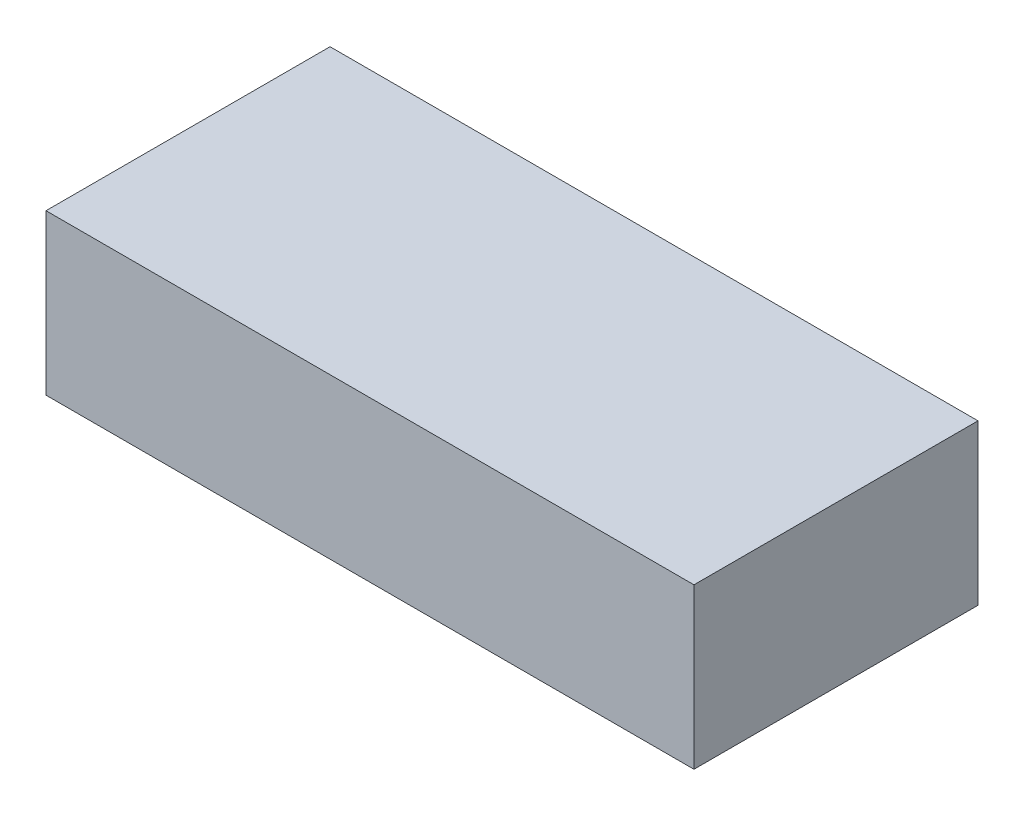
ISO-10303-21;
HEADER;
FILE_DESCRIPTION(('STEP AP214'),'2;1');
FILE_NAME('part.step','',(''),(''),'','','');
FILE_SCHEMA(('AUTOMOTIVE_DESIGN { 1 0 10303 214 1 1 1 1 }'));
ENDSEC;
DATA;
#1=APPLICATION_CONTEXT('core data for automotive mechanical design processes');
#2=APPLICATION_PROTOCOL_DEFINITION('international standard','automotive_design',2000,#1);
#3=PRODUCT_CONTEXT('',#1,'mechanical');
#4=PRODUCT('Part','Part','',(#3));
#5=PRODUCT_RELATED_PRODUCT_CATEGORY('part','',(#4));
#6=PRODUCT_DEFINITION_FORMATION('','',#4);
#7=PRODUCT_DEFINITION_CONTEXT('part definition',#1,'design');
#8=PRODUCT_DEFINITION('design','',#6,#7);
#9=PRODUCT_DEFINITION_SHAPE('','',#8);
#10=(LENGTH_UNIT() NAMED_UNIT(*) SI_UNIT(.MILLI.,.METRE.));
#11=(NAMED_UNIT(*) PLANE_ANGLE_UNIT() SI_UNIT($,.RADIAN.));
#12=(NAMED_UNIT(*) SI_UNIT($,.STERADIAN.) SOLID_ANGLE_UNIT());
#13=UNCERTAINTY_MEASURE_WITH_UNIT(LENGTH_MEASURE(1.E-05),#10,'distance_accuracy_value','');
#14=(GEOMETRIC_REPRESENTATION_CONTEXT(3) GLOBAL_UNCERTAINTY_ASSIGNED_CONTEXT((#13)) GLOBAL_UNIT_ASSIGNED_CONTEXT((#10,
#11,#12)) REPRESENTATION_CONTEXT('',''));
#15=CARTESIAN_POINT('',(0.,0.,0.));
#16=DIRECTION('',(0.,0.,1.));
#17=DIRECTION('',(1.,0.,0.));
#18=AXIS2_PLACEMENT_3D('',#15,#16,#17);
#19=CARTESIAN_POINT('',(36.5,18.,-16.));
#20=DIRECTION('',(-1.,0.,0.));
#21=DIRECTION('',(0.,0.,1.));
#22=AXIS2_PLACEMENT_3D('',#19,#20,#21);
#23=PLANE('',#22);
#24=DIRECTION('',(0.,0.,-1.));
#25=VECTOR('',#24,1.);
#26=CARTESIAN_POINT('',(36.5,0.,-16.));
#27=LINE('',#26,#25);
#28=CARTESIAN_POINT('',(36.5,0.,16.));
#29=VERTEX_POINT('',#28);
#30=CARTESIAN_POINT('',(36.5,0.,-16.));
#31=VERTEX_POINT('',#30);
#32=EDGE_CURVE('E104',#29,#31,#27,.T.);
#33=ORIENTED_EDGE('',*,*,#32,.T.);
#34=DIRECTION('',(0.,-1.,0.));
#35=VECTOR('',#34,1.);
#36=CARTESIAN_POINT('',(36.5,18.,-16.));
#37=LINE('',#36,#35);
#38=CARTESIAN_POINT('',(36.5,18.,-16.));
#39=VERTEX_POINT('',#38);
#40=EDGE_CURVE('E11',#39,#31,#37,.T.);
#41=ORIENTED_EDGE('',*,*,#40,.F.);
#42=DIRECTION('',(0.,0.,-1.));
#43=VECTOR('',#42,1.);
#44=CARTESIAN_POINT('',(36.5,18.,-16.));
#45=LINE('',#44,#43);
#46=CARTESIAN_POINT('',(36.5,18.,16.));
#47=VERTEX_POINT('',#46);
#48=EDGE_CURVE('E92',#47,#39,#45,.T.);
#49=ORIENTED_EDGE('',*,*,#48,.F.);
#50=DIRECTION('',(0.,-1.,0.));
#51=VECTOR('',#50,1.);
#52=CARTESIAN_POINT('',(36.5,18.,16.));
#53=LINE('',#52,#51);
#54=EDGE_CURVE('E100',#47,#29,#53,.T.);
#55=ORIENTED_EDGE('',*,*,#54,.T.);
#56=EDGE_LOOP('',(#33,#41,#49,#55));
#57=FACE_BOUND('',#56,.T.);
#58=ADVANCED_FACE('F41',(#57),#23,.F.);
#59=CARTESIAN_POINT('',(-36.5,18.,-16.));
#60=DIRECTION('',(0.,0.,1.));
#61=DIRECTION('',(1.,0.,0.));
#62=AXIS2_PLACEMENT_3D('',#59,#60,#61);
#63=PLANE('',#62);
#64=DIRECTION('',(-1.,0.,0.));
#65=VECTOR('',#64,1.);
#66=CARTESIAN_POINT('',(-36.5,0.,-16.));
#67=LINE('',#66,#65);
#68=CARTESIAN_POINT('',(-36.5,0.,-16.));
#69=VERTEX_POINT('',#68);
#70=EDGE_CURVE('E96',#31,#69,#67,.T.);
#71=ORIENTED_EDGE('',*,*,#70,.T.);
#72=DIRECTION('',(0.,-1.,0.));
#73=VECTOR('',#72,1.);
#74=CARTESIAN_POINT('',(-36.5,18.,-16.));
#75=LINE('',#74,#73);
#76=CARTESIAN_POINT('',(-36.5,18.,-16.));
#77=VERTEX_POINT('',#76);
#78=EDGE_CURVE('E49',#77,#69,#75,.T.);
#79=ORIENTED_EDGE('',*,*,#78,.F.);
#80=DIRECTION('',(-1.,0.,0.));
#81=VECTOR('',#80,1.);
#82=CARTESIAN_POINT('',(-36.5,18.,-16.));
#83=LINE('',#82,#81);
#84=EDGE_CURVE('E87',#39,#77,#83,.T.);
#85=ORIENTED_EDGE('',*,*,#84,.F.);
#86=ORIENTED_EDGE('',*,*,#40,.T.);
#87=EDGE_LOOP('',(#71,#79,#85,#86));
#88=FACE_BOUND('',#87,.T.);
#89=ADVANCED_FACE('F95',(#88),#63,.F.);
#90=CARTESIAN_POINT('',(-36.5,18.,-16.));
#91=DIRECTION('',(1.,0.,0.));
#92=DIRECTION('',(0.,0.,-1.));
#93=AXIS2_PLACEMENT_3D('',#90,#91,#92);
#94=PLANE('',#93);
#95=DIRECTION('',(0.,0.,1.));
#96=VECTOR('',#95,1.);
#97=CARTESIAN_POINT('',(-36.5,0.,-16.));
#98=LINE('',#97,#96);
#99=CARTESIAN_POINT('',(-36.5,0.,16.));
#100=VERTEX_POINT('',#99);
#101=EDGE_CURVE('E74',#69,#100,#98,.T.);
#102=ORIENTED_EDGE('',*,*,#101,.T.);
#103=DIRECTION('',(0.,-1.,0.));
#104=VECTOR('',#103,1.);
#105=CARTESIAN_POINT('',(-36.5,18.,16.));
#106=LINE('',#105,#104);
#107=CARTESIAN_POINT('',(-36.5,18.,16.));
#108=VERTEX_POINT('',#107);
#109=EDGE_CURVE('E97',#108,#100,#106,.T.);
#110=ORIENTED_EDGE('',*,*,#109,.F.);
#111=DIRECTION('',(0.,0.,1.));
#112=VECTOR('',#111,1.);
#113=CARTESIAN_POINT('',(-36.5,18.,-16.));
#114=LINE('',#113,#112);
#115=EDGE_CURVE('E90',#77,#108,#114,.T.);
#116=ORIENTED_EDGE('',*,*,#115,.F.);
#117=ORIENTED_EDGE('',*,*,#78,.T.);
#118=EDGE_LOOP('',(#102,#110,#116,#117));
#119=FACE_BOUND('',#118,.T.);
#120=ADVANCED_FACE('F98',(#119),#94,.F.);
#121=CARTESIAN_POINT('',(-36.5,18.,16.));
#122=DIRECTION('',(0.,0.,-1.));
#123=DIRECTION('',(-1.,0.,0.));
#124=AXIS2_PLACEMENT_3D('',#121,#122,#123);
#125=PLANE('',#124);
#126=DIRECTION('',(1.,0.,0.));
#127=VECTOR('',#126,1.);
#128=CARTESIAN_POINT('',(-36.5,0.,16.));
#129=LINE('',#128,#127);
#130=EDGE_CURVE('E80',#100,#29,#129,.T.);
#131=ORIENTED_EDGE('',*,*,#130,.T.);
#132=ORIENTED_EDGE('',*,*,#54,.F.);
#133=DIRECTION('',(1.,0.,0.));
#134=VECTOR('',#133,1.);
#135=CARTESIAN_POINT('',(-36.5,18.,16.));
#136=LINE('',#135,#134);
#137=EDGE_CURVE('E57',#108,#47,#136,.T.);
#138=ORIENTED_EDGE('',*,*,#137,.F.);
#139=ORIENTED_EDGE('',*,*,#109,.T.);
#140=EDGE_LOOP('',(#131,#132,#138,#139));
#141=FACE_BOUND('',#140,.T.);
#142=ADVANCED_FACE('F111',(#141),#125,.F.);
#143=CARTESIAN_POINT('',(0.,18.,0.));
#144=DIRECTION('',(0.,1.,0.));
#145=DIRECTION('',(0.,0.,1.));
#146=AXIS2_PLACEMENT_3D('',#143,#144,#145);
#147=PLANE('',#146);
#148=ORIENTED_EDGE('',*,*,#48,.T.);
#149=ORIENTED_EDGE('',*,*,#84,.T.);
#150=ORIENTED_EDGE('',*,*,#115,.T.);
#151=ORIENTED_EDGE('',*,*,#137,.T.);
#152=EDGE_LOOP('',(#148,#149,#150,#151));
#153=FACE_BOUND('',#152,.T.);
#154=ADVANCED_FACE('F88',(#153),#147,.T.);
#155=CARTESIAN_POINT('',(0.,0.,0.));
#156=DIRECTION('',(0.,1.,0.));
#157=DIRECTION('',(0.,0.,1.));
#158=AXIS2_PLACEMENT_3D('',#155,#156,#157);
#159=PLANE('',#158);
#160=ORIENTED_EDGE('',*,*,#32,.F.);
#161=ORIENTED_EDGE('',*,*,#130,.F.);
#162=ORIENTED_EDGE('',*,*,#101,.F.);
#163=ORIENTED_EDGE('',*,*,#70,.F.);
#164=EDGE_LOOP('',(#160,#161,#162,#163));
#165=FACE_BOUND('',#164,.T.);
#166=ADVANCED_FACE('F114',(#165),#159,.F.);
#167=CLOSED_SHELL('',(#58,#89,#120,#142,#154,#166));
#168=MANIFOLD_SOLID_BREP('B2',#167);
#169=ADVANCED_BREP_SHAPE_REPRESENTATION('',(#18,#168),#14);
#170=SHAPE_DEFINITION_REPRESENTATION(#9,#169);
ENDSEC;
END-ISO-10303-21;
